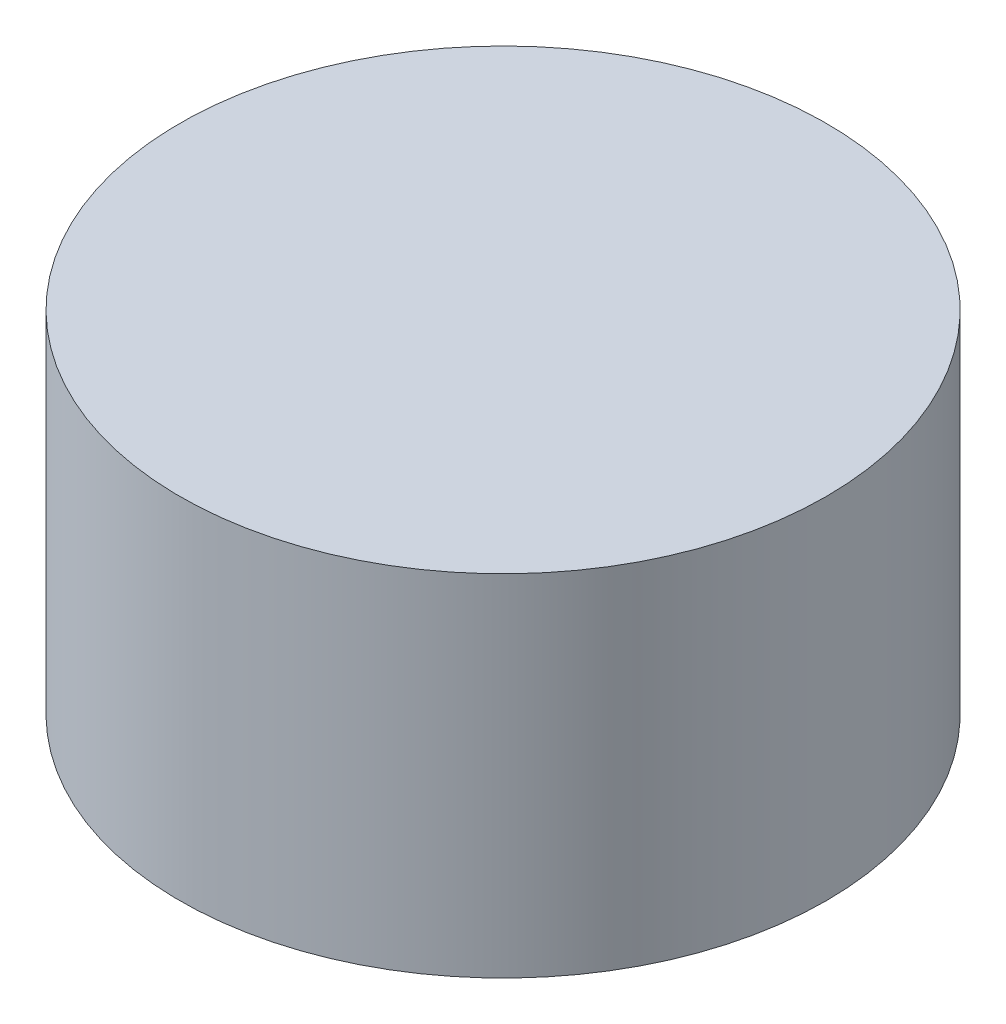
ISO-10303-21;
HEADER;
FILE_DESCRIPTION(('STEP AP214'),'2;1');
FILE_NAME('part.step','',(''),(''),'','','');
FILE_SCHEMA(('AUTOMOTIVE_DESIGN { 1 0 10303 214 1 1 1 1 }'));
ENDSEC;
DATA;
#1=APPLICATION_CONTEXT('core data for automotive mechanical design processes');
#2=APPLICATION_PROTOCOL_DEFINITION('international standard','automotive_design',2000,#1);
#3=PRODUCT_CONTEXT('',#1,'mechanical');
#4=PRODUCT('Part','Part','',(#3));
#5=PRODUCT_RELATED_PRODUCT_CATEGORY('part','',(#4));
#6=PRODUCT_DEFINITION_FORMATION('','',#4);
#7=PRODUCT_DEFINITION_CONTEXT('part definition',#1,'design');
#8=PRODUCT_DEFINITION('design','',#6,#7);
#9=PRODUCT_DEFINITION_SHAPE('','',#8);
#10=(LENGTH_UNIT() NAMED_UNIT(*) SI_UNIT(.MILLI.,.METRE.));
#11=(NAMED_UNIT(*) PLANE_ANGLE_UNIT() SI_UNIT($,.RADIAN.));
#12=(NAMED_UNIT(*) SI_UNIT($,.STERADIAN.) SOLID_ANGLE_UNIT());
#13=UNCERTAINTY_MEASURE_WITH_UNIT(LENGTH_MEASURE(1.E-05),#10,'distance_accuracy_value','');
#14=(GEOMETRIC_REPRESENTATION_CONTEXT(3) GLOBAL_UNCERTAINTY_ASSIGNED_CONTEXT((#13)) GLOBAL_UNIT_ASSIGNED_CONTEXT((#10,
#11,#12)) REPRESENTATION_CONTEXT('',''));
#15=CARTESIAN_POINT('',(0.,0.,0.));
#16=DIRECTION('',(0.,0.,1.));
#17=DIRECTION('',(1.,0.,0.));
#18=AXIS2_PLACEMENT_3D('',#15,#16,#17);
#19=CARTESIAN_POINT('',(0.,72.5,0.));
#20=DIRECTION('',(0.,-1.,0.));
#21=DIRECTION('',(0.,0.,-1.));
#22=AXIS2_PLACEMENT_3D('',#19,#20,#21);
#23=PLANE('',#22);
#24=CARTESIAN_POINT('',(0.,72.5,0.));
#25=DIRECTION('',(0.,1.,0.));
#26=DIRECTION('',(-1.,0.,0.));
#27=AXIS2_PLACEMENT_3D('',#24,#25,#26);
#28=CIRCLE('',#27,18.);
#29=CARTESIAN_POINT('',(18.,72.5,0.));
#30=VERTEX_POINT('',#29);
#31=EDGE_CURVE('E41',#30,#30,#28,.T.);
#32=ORIENTED_EDGE('',*,*,#31,.T.);
#33=EDGE_LOOP('',(#32));
#34=FACE_BOUND('',#33,.T.);
#35=ADVANCED_FACE('F16',(#34),#23,.F.);
#36=CARTESIAN_POINT('',(0.,53.,0.));
#37=DIRECTION('',(0.,1.,0.));
#38=DIRECTION('',(1.,0.,0.));
#39=AXIS2_PLACEMENT_3D('',#36,#37,#38);
#40=PLANE('',#39);
#41=CARTESIAN_POINT('',(0.,53.,0.));
#42=DIRECTION('',(0.,1.,0.));
#43=DIRECTION('',(-1.,0.,0.));
#44=AXIS2_PLACEMENT_3D('',#41,#42,#43);
#45=CIRCLE('',#44,18.);
#46=CARTESIAN_POINT('',(18.,53.,0.));
#47=VERTEX_POINT('',#46);
#48=EDGE_CURVE('E11',#47,#47,#45,.T.);
#49=ORIENTED_EDGE('',*,*,#48,.F.);
#50=EDGE_LOOP('',(#49));
#51=FACE_BOUND('',#50,.T.);
#52=ADVANCED_FACE('F62',(#51),#40,.F.);
#53=CARTESIAN_POINT('',(0.,53.,0.));
#54=DIRECTION('',(0.,1.,0.));
#55=DIRECTION('',(-1.,0.,0.));
#56=AXIS2_PLACEMENT_3D('',#53,#54,#55);
#57=CYLINDRICAL_SURFACE('',#56,18.);
#58=ORIENTED_EDGE('',*,*,#31,.F.);
#59=DIRECTION('',(0.,-1.,0.));
#60=VECTOR('',#59,1.);
#61=CARTESIAN_POINT('',(18.,53.,0.));
#62=LINE('',#61,#60);
#63=EDGE_CURVE('E20',#30,#47,#62,.T.);
#64=ORIENTED_EDGE('',*,*,#63,.T.);
#65=ORIENTED_EDGE('',*,*,#48,.T.);
#66=ORIENTED_EDGE('',*,*,#63,.F.);
#67=EDGE_LOOP('',(#58,#64,#65,#66));
#68=FACE_BOUND('',#67,.T.);
#69=ADVANCED_FACE('F18',(#68),#57,.T.);
#70=CLOSED_SHELL('',(#35,#52,#69));
#71=MANIFOLD_SOLID_BREP('B1',#70);
#72=ADVANCED_BREP_SHAPE_REPRESENTATION('',(#18,#71),#14);
#73=SHAPE_DEFINITION_REPRESENTATION(#9,#72);
ENDSEC;
END-ISO-10303-21;
